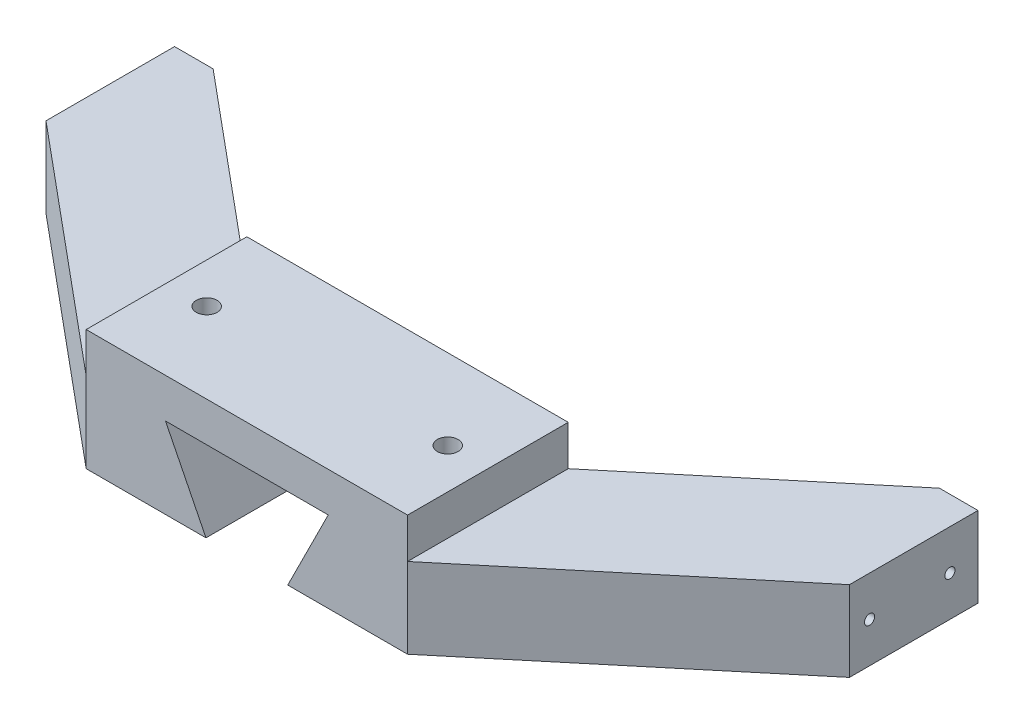
ISO-10303-21;
HEADER;
FILE_DESCRIPTION(('STEP AP214'),'2;1');
FILE_NAME('part.step','',(''),(''),'','','');
FILE_SCHEMA(('AUTOMOTIVE_DESIGN { 1 0 10303 214 1 1 1 1 }'));
ENDSEC;
DATA;
#1=APPLICATION_CONTEXT('core data for automotive mechanical design processes');
#2=APPLICATION_PROTOCOL_DEFINITION('international standard','automotive_design',2000,#1);
#3=PRODUCT_CONTEXT('',#1,'mechanical');
#4=PRODUCT('Part','Part','',(#3));
#5=PRODUCT_RELATED_PRODUCT_CATEGORY('part','',(#4));
#6=PRODUCT_DEFINITION_FORMATION('','',#4);
#7=PRODUCT_DEFINITION_CONTEXT('part definition',#1,'design');
#8=PRODUCT_DEFINITION('design','',#6,#7);
#9=PRODUCT_DEFINITION_SHAPE('','',#8);
#10=(LENGTH_UNIT() NAMED_UNIT(*) SI_UNIT(.MILLI.,.METRE.));
#11=(NAMED_UNIT(*) PLANE_ANGLE_UNIT() SI_UNIT($,.RADIAN.));
#12=(NAMED_UNIT(*) SI_UNIT($,.STERADIAN.) SOLID_ANGLE_UNIT());
#13=UNCERTAINTY_MEASURE_WITH_UNIT(LENGTH_MEASURE(1.E-05),#10,'distance_accuracy_value','');
#14=(GEOMETRIC_REPRESENTATION_CONTEXT(3) GLOBAL_UNCERTAINTY_ASSIGNED_CONTEXT((#13)) GLOBAL_UNIT_ASSIGNED_CONTEXT((#10,
#11,#12)) REPRESENTATION_CONTEXT('',''));
#15=CARTESIAN_POINT('',(0.,0.,0.));
#16=DIRECTION('',(0.,0.,1.));
#17=DIRECTION('',(1.,0.,0.));
#18=AXIS2_PLACEMENT_3D('',#15,#16,#17);
#19=CARTESIAN_POINT('',(-25.4,-9.525,25.4));
#20=DIRECTION('',(1.,0.,0.));
#21=DIRECTION('',(0.,0.,-1.));
#22=AXIS2_PLACEMENT_3D('',#19,#20,#21);
#23=PLANE('',#22);
#24=DIRECTION('',(0.,0.,-1.));
#25=VECTOR('',#24,1.);
#26=CARTESIAN_POINT('',(-25.4,3.175,25.4));
#27=LINE('',#26,#25);
#28=CARTESIAN_POINT('',(-25.4,3.175,25.4));
#29=VERTEX_POINT('',#28);
#30=CARTESIAN_POINT('',(-25.4,3.175,0.));
#31=VERTEX_POINT('',#30);
#32=EDGE_CURVE('E60',#29,#31,#27,.T.);
#33=ORIENTED_EDGE('',*,*,#32,.F.);
#34=DIRECTION('',(0.,-1.,0.));
#35=VECTOR('',#34,1.);
#36=CARTESIAN_POINT('',(-25.4,-9.525,25.4));
#37=LINE('',#36,#35);
#38=CARTESIAN_POINT('',(-25.4,9.525,25.4));
#39=VERTEX_POINT('',#38);
#40=EDGE_CURVE('E278',#39,#29,#37,.T.);
#41=ORIENTED_EDGE('',*,*,#40,.F.);
#42=DIRECTION('',(0.,0.,-1.));
#43=VECTOR('',#42,1.);
#44=CARTESIAN_POINT('',(-25.4,9.525,25.4));
#45=LINE('',#44,#43);
#46=CARTESIAN_POINT('',(-25.4,9.525,0.));
#47=VERTEX_POINT('',#46);
#48=EDGE_CURVE('E291',#39,#47,#45,.T.);
#49=ORIENTED_EDGE('',*,*,#48,.T.);
#50=DIRECTION('',(0.,-1.,0.));
#51=VECTOR('',#50,1.);
#52=CARTESIAN_POINT('',(-25.4,-9.525,0.));
#53=LINE('',#52,#51);
#54=EDGE_CURVE('E277',#47,#31,#53,.T.);
#55=ORIENTED_EDGE('',*,*,#54,.T.);
#56=EDGE_LOOP('',(#33,#41,#49,#55));
#57=FACE_BOUND('',#56,.T.);
#58=ADVANCED_FACE('F38',(#57),#23,.F.);
#59=CARTESIAN_POINT('',(25.4,-9.525,25.4));
#60=DIRECTION('',(0.,1.,0.));
#61=DIRECTION('',(-1.,0.,0.));
#62=AXIS2_PLACEMENT_3D('',#59,#60,#61);
#63=PLANE('',#62);
#64=DIRECTION('',(-1.,0.,0.));
#65=VECTOR('',#64,1.);
#66=CARTESIAN_POINT('',(0.,-9.525,-26.67));
#67=LINE('',#66,#65);
#68=CARTESIAN_POINT('',(63.5,-9.52499999999999,-26.67));
#69=VERTEX_POINT('',#68);
#70=CARTESIAN_POINT('',(57.404,-9.52499999999999,-26.67));
#71=VERTEX_POINT('',#70);
#72=EDGE_CURVE('E205',#69,#71,#67,.T.);
#73=ORIENTED_EDGE('',*,*,#72,.F.);
#74=DIRECTION('',(0.,0.,1.));
#75=VECTOR('',#74,1.);
#76=CARTESIAN_POINT('',(63.5,-9.52499999999999,-6.35));
#77=LINE('',#76,#75);
#78=CARTESIAN_POINT('',(63.5,-9.52499999999999,-6.35));
#79=VERTEX_POINT('',#78);
#80=EDGE_CURVE('E242',#69,#79,#77,.T.);
#81=ORIENTED_EDGE('',*,*,#80,.T.);
#82=DIRECTION('',(-0.768221279597376,0.,0.64018439966448));
#83=VECTOR('',#82,1.);
#84=CARTESIAN_POINT('',(25.4,-9.525,25.4));
#85=LINE('',#84,#83);
#86=CARTESIAN_POINT('',(25.4,-9.525,25.4));
#87=VERTEX_POINT('',#86);
#88=EDGE_CURVE('E231',#79,#87,#85,.T.);
#89=ORIENTED_EDGE('',*,*,#88,.T.);
#90=DIRECTION('',(1.,0.,0.));
#91=VECTOR('',#90,1.);
#92=CARTESIAN_POINT('',(25.4,-9.525,25.4));
#93=LINE('',#92,#91);
#94=CARTESIAN_POINT('',(6.46180339887498,-9.525,25.4));
#95=VERTEX_POINT('',#94);
#96=EDGE_CURVE('E280',#95,#87,#93,.T.);
#97=ORIENTED_EDGE('',*,*,#96,.F.);
#98=DIRECTION('',(0.,0.,1.));
#99=VECTOR('',#98,1.);
#100=CARTESIAN_POINT('',(6.46180339887498,-9.525,-1.2E-05));
#101=LINE('',#100,#99);
#102=CARTESIAN_POINT('',(6.46180339887498,-9.525,0.));
#103=VERTEX_POINT('',#102);
#104=EDGE_CURVE('E263',#103,#95,#101,.T.);
#105=ORIENTED_EDGE('',*,*,#104,.F.);
#106=DIRECTION('',(1.,0.,0.));
#107=VECTOR('',#106,1.);
#108=CARTESIAN_POINT('',(25.4,-9.525,0.));
#109=LINE('',#108,#107);
#110=CARTESIAN_POINT('',(25.4,-9.525,0.));
#111=VERTEX_POINT('',#110);
#112=EDGE_CURVE('E293',#103,#111,#109,.T.);
#113=ORIENTED_EDGE('',*,*,#112,.T.);
#114=DIRECTION('',(0.768221279597376,0.,-0.64018439966448));
#115=VECTOR('',#114,1.);
#116=CARTESIAN_POINT('',(63.5,-9.52499999999999,-31.75));
#117=LINE('',#116,#115);
#118=EDGE_CURVE('E226',#111,#71,#117,.T.);
#119=ORIENTED_EDGE('',*,*,#118,.T.);
#120=EDGE_LOOP('',(#73,#81,#89,#97,#105,#113,#119));
#121=FACE_BOUND('',#120,.T.);
#122=ADVANCED_FACE('F375',(#121),#63,.F.);
#123=CARTESIAN_POINT('',(63.5,3.17500000000001,-6.35));
#124=DIRECTION('',(1.,0.,0.));
#125=DIRECTION('',(0.,1.,0.));
#126=AXIS2_PLACEMENT_3D('',#123,#124,#125);
#127=PLANE('',#126);
#128=CARTESIAN_POINT('',(63.5,-3.17499999999999,-22.225));
#129=DIRECTION('',(1.,0.,0.));
#130=DIRECTION('',(0.,0.,-1.));
#131=AXIS2_PLACEMENT_3D('',#128,#129,#130);
#132=CIRCLE('',#131,0.79999999999999);
#133=CARTESIAN_POINT('',(63.5,-3.17499999999999,-23.025));
#134=VERTEX_POINT('',#133);
#135=EDGE_CURVE('E212',#134,#134,#132,.T.);
#136=ORIENTED_EDGE('',*,*,#135,.F.);
#137=EDGE_LOOP('',(#136));
#138=FACE_BOUND('',#137,.T.);
#139=CARTESIAN_POINT('',(63.5,-3.17499999999999,-9.525));
#140=DIRECTION('',(1.,0.,0.));
#141=DIRECTION('',(0.,0.,-1.));
#142=AXIS2_PLACEMENT_3D('',#139,#140,#141);
#143=CIRCLE('',#142,0.79999999999999);
#144=CARTESIAN_POINT('',(63.5,-3.17499999999999,-10.325));
#145=VERTEX_POINT('',#144);
#146=EDGE_CURVE('E220',#145,#145,#143,.T.);
#147=ORIENTED_EDGE('',*,*,#146,.F.);
#148=EDGE_LOOP('',(#147));
#149=FACE_BOUND('',#148,.T.);
#150=ORIENTED_EDGE('',*,*,#80,.F.);
#151=DIRECTION('',(0.,1.,0.));
#152=VECTOR('',#151,1.);
#153=CARTESIAN_POINT('',(63.5,-9.52499999999999,-26.67));
#154=LINE('',#153,#152);
#155=CARTESIAN_POINT('',(63.5,3.17500000000001,-26.67));
#156=VERTEX_POINT('',#155);
#157=EDGE_CURVE('E207',#69,#156,#154,.T.);
#158=ORIENTED_EDGE('',*,*,#157,.T.);
#159=DIRECTION('',(0.,0.,1.));
#160=VECTOR('',#159,1.);
#161=CARTESIAN_POINT('',(63.5,3.17500000000001,-6.35));
#162=LINE('',#161,#160);
#163=CARTESIAN_POINT('',(63.5,3.17500000000001,-6.35));
#164=VERTEX_POINT('',#163);
#165=EDGE_CURVE('E234',#156,#164,#162,.T.);
#166=ORIENTED_EDGE('',*,*,#165,.T.);
#167=DIRECTION('',(0.,-1.,0.));
#168=VECTOR('',#167,1.);
#169=CARTESIAN_POINT('',(63.5,3.17500000000001,-6.35));
#170=LINE('',#169,#168);
#171=EDGE_CURVE('E239',#164,#79,#170,.T.);
#172=ORIENTED_EDGE('',*,*,#171,.T.);
#173=EDGE_LOOP('',(#150,#158,#166,#172));
#174=FACE_BOUND('',#173,.T.);
#175=ADVANCED_FACE('F379',(#138,#149,#174),#127,.T.);
#176=CARTESIAN_POINT('',(63.5,3.17500000000001,-31.75));
#177=DIRECTION('',(-0.64018439966448,0.,-0.768221279597376));
#178=DIRECTION('',(-0.768221279597376,0.,0.64018439966448));
#179=AXIS2_PLACEMENT_3D('',#176,#177,#178);
#180=PLANE('',#179);
#181=DIRECTION('',(0.768221279597376,0.,-0.64018439966448));
#182=VECTOR('',#181,1.);
#183=CARTESIAN_POINT('',(63.5,3.17500000000001,-31.75));
#184=LINE('',#183,#182);
#185=CARTESIAN_POINT('',(25.4,3.175,0.));
#186=VERTEX_POINT('',#185);
#187=CARTESIAN_POINT('',(57.404,3.17500000000001,-26.67));
#188=VERTEX_POINT('',#187);
#189=EDGE_CURVE('E230',#186,#188,#184,.T.);
#190=ORIENTED_EDGE('',*,*,#189,.T.);
#191=DIRECTION('',(0.,1.,0.));
#192=VECTOR('',#191,1.);
#193=CARTESIAN_POINT('',(57.404,-9.52499999999999,-26.67));
#194=LINE('',#193,#192);
#195=EDGE_CURVE('E210',#71,#188,#194,.T.);
#196=ORIENTED_EDGE('',*,*,#195,.F.);
#197=ORIENTED_EDGE('',*,*,#118,.F.);
#198=DIRECTION('',(0.,1.,0.));
#199=VECTOR('',#198,1.);
#200=CARTESIAN_POINT('',(25.4,-9.525,0.));
#201=LINE('',#200,#199);
#202=EDGE_CURVE('E297',#111,#186,#201,.T.);
#203=ORIENTED_EDGE('',*,*,#202,.T.);
#204=EDGE_LOOP('',(#190,#196,#197,#203));
#205=FACE_BOUND('',#204,.T.);
#206=ADVANCED_FACE('F384',(#205),#180,.T.);
#207=CARTESIAN_POINT('',(0.,3.175,0.));
#208=DIRECTION('',(0.,1.,0.));
#209=DIRECTION('',(-1.,0.,0.));
#210=AXIS2_PLACEMENT_3D('',#207,#208,#209);
#211=PLANE('',#210);
#212=ORIENTED_EDGE('',*,*,#165,.F.);
#213=DIRECTION('',(-1.,0.,0.));
#214=VECTOR('',#213,1.);
#215=CARTESIAN_POINT('',(0.,3.175,-26.67));
#216=LINE('',#215,#214);
#217=EDGE_CURVE('E198',#156,#188,#216,.T.);
#218=ORIENTED_EDGE('',*,*,#217,.T.);
#219=ORIENTED_EDGE('',*,*,#189,.F.);
#220=DIRECTION('',(0.,0.,-1.));
#221=VECTOR('',#220,1.);
#222=CARTESIAN_POINT('',(25.4,3.175,25.4));
#223=LINE('',#222,#221);
#224=CARTESIAN_POINT('',(25.4,3.175,25.4));
#225=VERTEX_POINT('',#224);
#226=EDGE_CURVE('E227',#225,#186,#223,.T.);
#227=ORIENTED_EDGE('',*,*,#226,.F.);
#228=DIRECTION('',(-0.768221279597376,0.,0.64018439966448));
#229=VECTOR('',#228,1.);
#230=CARTESIAN_POINT('',(25.4,3.175,25.4));
#231=LINE('',#230,#229);
#232=EDGE_CURVE('E236',#164,#225,#231,.T.);
#233=ORIENTED_EDGE('',*,*,#232,.F.);
#234=EDGE_LOOP('',(#212,#218,#219,#227,#233));
#235=FACE_BOUND('',#234,.T.);
#236=ADVANCED_FACE('F391',(#235),#211,.T.);
#237=DIRECTION('',(0.,0.,1.));
#238=VECTOR('',#237,1.);
#239=CARTESIAN_POINT('',(-63.5,-9.52499999999999,-6.35));
#240=LINE('',#239,#238);
#241=CARTESIAN_POINT('',(-63.5,-9.52499999999999,-26.67));
#242=VERTEX_POINT('',#241);
#243=CARTESIAN_POINT('',(-63.5,-9.52499999999999,-6.35));
#244=VERTEX_POINT('',#243);
#245=EDGE_CURVE('E185',#242,#244,#240,.T.);
#246=ORIENTED_EDGE('',*,*,#245,.F.);
#247=DIRECTION('',(1.,0.,0.));
#248=VECTOR('',#247,1.);
#249=CARTESIAN_POINT('',(0.,-9.525,-26.67));
#250=LINE('',#249,#248);
#251=CARTESIAN_POINT('',(-57.404,-9.52499999999999,-26.67));
#252=VERTEX_POINT('',#251);
#253=EDGE_CURVE('E170',#242,#252,#250,.T.);
#254=ORIENTED_EDGE('',*,*,#253,.T.);
#255=DIRECTION('',(-0.768221279597376,0.,-0.64018439966448));
#256=VECTOR('',#255,1.);
#257=CARTESIAN_POINT('',(-63.5,-9.52499999999999,-31.75));
#258=LINE('',#257,#256);
#259=CARTESIAN_POINT('',(-25.4,-9.525,0.));
#260=VERTEX_POINT('',#259);
#261=EDGE_CURVE('E182',#260,#252,#258,.T.);
#262=ORIENTED_EDGE('',*,*,#261,.F.);
#263=CARTESIAN_POINT('',(-6.46180339887498,-9.525,0.));
#264=VERTEX_POINT('',#263);
#265=EDGE_CURVE('E294',#260,#264,#109,.T.);
#266=ORIENTED_EDGE('',*,*,#265,.T.);
#267=DIRECTION('',(0.,0.,1.));
#268=VECTOR('',#267,1.);
#269=CARTESIAN_POINT('',(-6.46180339887498,-9.525,-1.2E-05));
#270=LINE('',#269,#268);
#271=CARTESIAN_POINT('',(-6.46180339887498,-9.525,25.4));
#272=VERTEX_POINT('',#271);
#273=EDGE_CURVE('E260',#264,#272,#270,.T.);
#274=ORIENTED_EDGE('',*,*,#273,.T.);
#275=CARTESIAN_POINT('',(-25.4,-9.525,25.4));
#276=VERTEX_POINT('',#275);
#277=EDGE_CURVE('E282',#276,#272,#93,.T.);
#278=ORIENTED_EDGE('',*,*,#277,.F.);
#279=DIRECTION('',(0.768221279597376,0.,0.64018439966448));
#280=VECTOR('',#279,1.);
#281=CARTESIAN_POINT('',(-25.4,-9.525,25.4));
#282=LINE('',#281,#280);
#283=EDGE_CURVE('E193',#244,#276,#282,.T.);
#284=ORIENTED_EDGE('',*,*,#283,.F.);
#285=EDGE_LOOP('',(#246,#254,#262,#266,#274,#278,#284));
#286=FACE_BOUND('',#285,.T.);
#287=ADVANCED_FACE('F180',(#286),#63,.F.);
#288=CARTESIAN_POINT('',(25.4,-9.525,25.4));
#289=DIRECTION('',(-1.,0.,0.));
#290=DIRECTION('',(0.,0.,1.));
#291=AXIS2_PLACEMENT_3D('',#288,#289,#290);
#292=PLANE('',#291);
#293=DIRECTION('',(0.,1.,0.));
#294=VECTOR('',#293,1.);
#295=CARTESIAN_POINT('',(25.4,-9.525,25.4));
#296=LINE('',#295,#294);
#297=CARTESIAN_POINT('',(25.4,9.525,25.4));
#298=VERTEX_POINT('',#297);
#299=EDGE_CURVE('E285',#225,#298,#296,.T.);
#300=ORIENTED_EDGE('',*,*,#299,.F.);
#301=ORIENTED_EDGE('',*,*,#226,.T.);
#302=CARTESIAN_POINT('',(25.4,9.525,0.));
#303=VERTEX_POINT('',#302);
#304=EDGE_CURVE('E296',#186,#303,#201,.T.);
#305=ORIENTED_EDGE('',*,*,#304,.T.);
#306=DIRECTION('',(0.,0.,-1.));
#307=VECTOR('',#306,1.);
#308=CARTESIAN_POINT('',(25.4,9.525,25.4));
#309=LINE('',#308,#307);
#310=EDGE_CURVE('E303',#298,#303,#309,.T.);
#311=ORIENTED_EDGE('',*,*,#310,.F.);
#312=EDGE_LOOP('',(#300,#301,#305,#311));
#313=FACE_BOUND('',#312,.T.);
#314=ADVANCED_FACE('F390',(#313),#292,.F.);
#315=CARTESIAN_POINT('',(25.4,9.525,25.4));
#316=DIRECTION('',(0.,-1.,0.));
#317=DIRECTION('',(1.,0.,0.));
#318=AXIS2_PLACEMENT_3D('',#315,#316,#317);
#319=PLANE('',#318);
#320=CARTESIAN_POINT('',(19.05,9.525,12.7));
#321=DIRECTION('',(0.,1.,0.));
#322=DIRECTION('',(0.,0.,1.));
#323=AXIS2_PLACEMENT_3D('',#320,#321,#322);
#324=CIRCLE('',#323,1.65);
#325=CARTESIAN_POINT('',(19.05,9.525,14.35));
#326=VERTEX_POINT('',#325);
#327=EDGE_CURVE('E248',#326,#326,#324,.T.);
#328=ORIENTED_EDGE('',*,*,#327,.F.);
#329=EDGE_LOOP('',(#328));
#330=FACE_BOUND('',#329,.T.);
#331=CARTESIAN_POINT('',(-19.05,9.525,12.7));
#332=DIRECTION('',(0.,1.,0.));
#333=DIRECTION('',(0.,0.,1.));
#334=AXIS2_PLACEMENT_3D('',#331,#332,#333);
#335=CIRCLE('',#334,1.65);
#336=CARTESIAN_POINT('',(-19.05,9.525,14.35));
#337=VERTEX_POINT('',#336);
#338=EDGE_CURVE('E254',#337,#337,#335,.T.);
#339=ORIENTED_EDGE('',*,*,#338,.F.);
#340=EDGE_LOOP('',(#339));
#341=FACE_BOUND('',#340,.T.);
#342=DIRECTION('',(-1.,0.,0.));
#343=VECTOR('',#342,1.);
#344=CARTESIAN_POINT('',(25.4,9.525,0.));
#345=LINE('',#344,#343);
#346=EDGE_CURVE('E281',#303,#47,#345,.T.);
#347=ORIENTED_EDGE('',*,*,#346,.T.);
#348=ORIENTED_EDGE('',*,*,#48,.F.);
#349=DIRECTION('',(-1.,0.,0.));
#350=VECTOR('',#349,1.);
#351=CARTESIAN_POINT('',(25.4,9.525,25.4));
#352=LINE('',#351,#350);
#353=EDGE_CURVE('E289',#298,#39,#352,.T.);
#354=ORIENTED_EDGE('',*,*,#353,.F.);
#355=ORIENTED_EDGE('',*,*,#310,.T.);
#356=EDGE_LOOP('',(#347,#348,#354,#355));
#357=FACE_BOUND('',#356,.T.);
#358=ADVANCED_FACE('F396',(#330,#341,#357),#319,.F.);
#359=CARTESIAN_POINT('',(0.,0.,25.4));
#360=DIRECTION('',(0.,0.,1.));
#361=DIRECTION('',(1.,0.,0.));
#362=AXIS2_PLACEMENT_3D('',#359,#360,#361);
#363=PLANE('',#362);
#364=DIRECTION('',(0.447213595499958,-0.894427190999916,0.));
#365=VECTOR('',#364,1.);
#366=CARTESIAN_POINT('',(-8.97944271909999,-4.48972135955,25.4));
#367=LINE('',#366,#365);
#368=CARTESIAN_POINT('',(-12.861803398875,3.27500000000001,25.4));
#369=VERTEX_POINT('',#368);
#370=EDGE_CURVE('E275',#369,#272,#367,.T.);
#371=ORIENTED_EDGE('',*,*,#370,.F.);
#372=DIRECTION('',(-1.,0.,0.));
#373=VECTOR('',#372,1.);
#374=CARTESIAN_POINT('',(0.,3.27500000000001,25.4));
#375=LINE('',#374,#373);
#376=CARTESIAN_POINT('',(12.861803398875,3.27500000000001,25.4));
#377=VERTEX_POINT('',#376);
#378=EDGE_CURVE('E273',#377,#369,#375,.T.);
#379=ORIENTED_EDGE('',*,*,#378,.F.);
#380=DIRECTION('',(0.447213595499958,0.894427190999916,0.));
#381=VECTOR('',#380,1.);
#382=CARTESIAN_POINT('',(8.97944271909999,-4.48972135954999,25.4));
#383=LINE('',#382,#381);
#384=EDGE_CURVE('E271',#95,#377,#383,.T.);
#385=ORIENTED_EDGE('',*,*,#384,.F.);
#386=ORIENTED_EDGE('',*,*,#96,.T.);
#387=EDGE_CURVE('E286',#87,#225,#296,.T.);
#388=ORIENTED_EDGE('',*,*,#387,.T.);
#389=ORIENTED_EDGE('',*,*,#299,.T.);
#390=ORIENTED_EDGE('',*,*,#353,.T.);
#391=ORIENTED_EDGE('',*,*,#40,.T.);
#392=DIRECTION('',(0.,-1.,0.));
#393=VECTOR('',#392,1.);
#394=CARTESIAN_POINT('',(-25.4,3.175,25.4));
#395=LINE('',#394,#393);
#396=EDGE_CURVE('E202',#29,#276,#395,.T.);
#397=ORIENTED_EDGE('',*,*,#396,.T.);
#398=ORIENTED_EDGE('',*,*,#277,.T.);
#399=EDGE_LOOP('',(#371,#379,#385,#386,#388,#389,#390,#391,#397,#398));
#400=FACE_BOUND('',#399,.T.);
#401=ADVANCED_FACE('F321',(#400),#363,.T.);
#402=CARTESIAN_POINT('',(0.,0.,0.));
#403=DIRECTION('',(0.,0.,1.));
#404=DIRECTION('',(1.,0.,0.));
#405=AXIS2_PLACEMENT_3D('',#402,#403,#404);
#406=PLANE('',#405);
#407=DIRECTION('',(-1.,0.,0.));
#408=VECTOR('',#407,1.);
#409=CARTESIAN_POINT('',(0.,3.27500000000001,0.));
#410=LINE('',#409,#408);
#411=CARTESIAN_POINT('',(12.861803398875,3.27500000000001,0.));
#412=VERTEX_POINT('',#411);
#413=CARTESIAN_POINT('',(-12.861803398875,3.27500000000001,0.));
#414=VERTEX_POINT('',#413);
#415=EDGE_CURVE('E45',#412,#414,#410,.T.);
#416=ORIENTED_EDGE('',*,*,#415,.T.);
#417=DIRECTION('',(0.447213595499958,-0.894427190999916,0.));
#418=VECTOR('',#417,1.);
#419=CARTESIAN_POINT('',(-8.97944271909999,-4.48972135955,0.));
#420=LINE('',#419,#418);
#421=EDGE_CURVE('E11',#414,#264,#420,.T.);
#422=ORIENTED_EDGE('',*,*,#421,.T.);
#423=ORIENTED_EDGE('',*,*,#265,.F.);
#424=DIRECTION('',(0.,-1.,0.));
#425=VECTOR('',#424,1.);
#426=CARTESIAN_POINT('',(-25.4,3.175,0.));
#427=LINE('',#426,#425);
#428=EDGE_CURVE('E189',#31,#260,#427,.T.);
#429=ORIENTED_EDGE('',*,*,#428,.F.);
#430=ORIENTED_EDGE('',*,*,#54,.F.);
#431=ORIENTED_EDGE('',*,*,#346,.F.);
#432=ORIENTED_EDGE('',*,*,#304,.F.);
#433=ORIENTED_EDGE('',*,*,#202,.F.);
#434=ORIENTED_EDGE('',*,*,#112,.F.);
#435=DIRECTION('',(0.447213595499958,0.894427190999916,0.));
#436=VECTOR('',#435,1.);
#437=CARTESIAN_POINT('',(8.97944271909999,-4.48972135954999,0.));
#438=LINE('',#437,#436);
#439=EDGE_CURVE('E306',#103,#412,#438,.T.);
#440=ORIENTED_EDGE('',*,*,#439,.T.);
#441=EDGE_LOOP('',(#416,#422,#423,#429,#430,#431,#432,#433,#434,#440));
#442=FACE_BOUND('',#441,.T.);
#443=ADVANCED_FACE('F311',(#442),#406,.F.);
#444=CARTESIAN_POINT('',(-8.97944271909999,-4.48972135955,-1.2E-05));
#445=DIRECTION('',(-0.894427190999916,-0.447213595499958,0.));
#446=DIRECTION('',(0.447213595499958,-0.894427190999916,0.));
#447=AXIS2_PLACEMENT_3D('',#444,#445,#446);
#448=PLANE('',#447);
#449=ORIENTED_EDGE('',*,*,#370,.T.);
#450=ORIENTED_EDGE('',*,*,#273,.F.);
#451=ORIENTED_EDGE('',*,*,#421,.F.);
#452=DIRECTION('',(0.,0.,1.));
#453=VECTOR('',#452,1.);
#454=CARTESIAN_POINT('',(-12.861803398875,3.27500000000001,-1.2E-05));
#455=LINE('',#454,#453);
#456=EDGE_CURVE('E268',#414,#369,#455,.T.);
#457=ORIENTED_EDGE('',*,*,#456,.T.);
#458=EDGE_LOOP('',(#449,#450,#451,#457));
#459=FACE_BOUND('',#458,.T.);
#460=ADVANCED_FACE('F319',(#459),#448,.F.);
#461=CARTESIAN_POINT('',(0.,3.27500000000001,-1.2E-05));
#462=DIRECTION('',(0.,1.,0.));
#463=DIRECTION('',(0.,0.,1.));
#464=AXIS2_PLACEMENT_3D('',#461,#462,#463);
#465=PLANE('',#464);
#466=ORIENTED_EDGE('',*,*,#378,.T.);
#467=ORIENTED_EDGE('',*,*,#456,.F.);
#468=ORIENTED_EDGE('',*,*,#415,.F.);
#469=DIRECTION('',(0.,0.,1.));
#470=VECTOR('',#469,1.);
#471=CARTESIAN_POINT('',(12.861803398875,3.27500000000001,-1.2E-05));
#472=LINE('',#471,#470);
#473=EDGE_CURVE('E265',#412,#377,#472,.T.);
#474=ORIENTED_EDGE('',*,*,#473,.T.);
#475=EDGE_LOOP('',(#466,#467,#468,#474));
#476=FACE_BOUND('',#475,.T.);
#477=ADVANCED_FACE('F315',(#476),#465,.F.);
#478=CARTESIAN_POINT('',(8.97944271909999,-4.48972135954999,-1.2E-05));
#479=DIRECTION('',(0.894427190999916,-0.447213595499958,0.));
#480=DIRECTION('',(0.447213595499958,0.894427190999916,0.));
#481=AXIS2_PLACEMENT_3D('',#478,#479,#480);
#482=PLANE('',#481);
#483=ORIENTED_EDGE('',*,*,#384,.T.);
#484=ORIENTED_EDGE('',*,*,#473,.F.);
#485=ORIENTED_EDGE('',*,*,#439,.F.);
#486=ORIENTED_EDGE('',*,*,#104,.T.);
#487=EDGE_LOOP('',(#483,#484,#485,#486));
#488=FACE_BOUND('',#487,.T.);
#489=ADVANCED_FACE('F429',(#488),#482,.F.);
#490=CARTESIAN_POINT('',(-19.05,-0.584200000000003,12.7));
#491=DIRECTION('',(0.,1.,0.));
#492=DIRECTION('',(0.,0.,1.));
#493=AXIS2_PLACEMENT_3D('',#490,#491,#492);
#494=CONICAL_SURFACE('',#493,1.65,1.02974425867665);
#495=CARTESIAN_POINT('',(-19.05,-1.57562002139548,12.7));
#496=VERTEX_POINT('',#495);
#497=VERTEX_LOOP('',#496);
#498=FACE_BOUND('',#497,.T.);
#499=CARTESIAN_POINT('',(-19.05,-0.584200000000003,12.7));
#500=DIRECTION('',(0.,1.,0.));
#501=DIRECTION('',(0.,0.,1.));
#502=AXIS2_PLACEMENT_3D('',#499,#500,#501);
#503=CIRCLE('',#502,1.65);
#504=CARTESIAN_POINT('',(-19.05,-0.584200000000003,14.35));
#505=VERTEX_POINT('',#504);
#506=EDGE_CURVE('E257',#505,#505,#503,.T.);
#507=ORIENTED_EDGE('',*,*,#506,.T.);
#508=EDGE_LOOP('',(#507));
#509=FACE_BOUND('',#508,.T.);
#510=ADVANCED_FACE('F425',(#498,#509),#494,.F.);
#511=CARTESIAN_POINT('',(-19.05,9.525,12.7));
#512=DIRECTION('',(0.,1.,0.));
#513=DIRECTION('',(0.,0.,1.));
#514=AXIS2_PLACEMENT_3D('',#511,#512,#513);
#515=CYLINDRICAL_SURFACE('',#514,1.65);
#516=ORIENTED_EDGE('',*,*,#506,.F.);
#517=EDGE_LOOP('',(#516));
#518=FACE_BOUND('',#517,.T.);
#519=ORIENTED_EDGE('',*,*,#338,.T.);
#520=EDGE_LOOP('',(#519));
#521=FACE_BOUND('',#520,.T.);
#522=ADVANCED_FACE('F421',(#518,#521),#515,.F.);
#523=CARTESIAN_POINT('',(19.05,-0.584199999999996,12.7));
#524=DIRECTION('',(0.,1.,0.));
#525=DIRECTION('',(0.,0.,1.));
#526=AXIS2_PLACEMENT_3D('',#523,#524,#525);
#527=CONICAL_SURFACE('',#526,1.65,1.02974425867665);
#528=CARTESIAN_POINT('',(19.05,-1.57562002139547,12.7));
#529=VERTEX_POINT('',#528);
#530=VERTEX_LOOP('',#529);
#531=FACE_BOUND('',#530,.T.);
#532=CARTESIAN_POINT('',(19.05,-0.584199999999996,12.7));
#533=DIRECTION('',(0.,1.,0.));
#534=DIRECTION('',(0.,0.,1.));
#535=AXIS2_PLACEMENT_3D('',#532,#533,#534);
#536=CIRCLE('',#535,1.65);
#537=CARTESIAN_POINT('',(19.05,-0.584199999999996,14.35));
#538=VERTEX_POINT('',#537);
#539=EDGE_CURVE('E251',#538,#538,#536,.T.);
#540=ORIENTED_EDGE('',*,*,#539,.T.);
#541=EDGE_LOOP('',(#540));
#542=FACE_BOUND('',#541,.T.);
#543=ADVANCED_FACE('F417',(#531,#542),#527,.F.);
#544=CARTESIAN_POINT('',(19.05,9.525,12.7));
#545=DIRECTION('',(0.,1.,0.));
#546=DIRECTION('',(0.,0.,1.));
#547=AXIS2_PLACEMENT_3D('',#544,#545,#546);
#548=CYLINDRICAL_SURFACE('',#547,1.65);
#549=ORIENTED_EDGE('',*,*,#539,.F.);
#550=EDGE_LOOP('',(#549));
#551=FACE_BOUND('',#550,.T.);
#552=ORIENTED_EDGE('',*,*,#327,.T.);
#553=EDGE_LOOP('',(#552));
#554=FACE_BOUND('',#553,.T.);
#555=ADVANCED_FACE('F412',(#551,#554),#548,.F.);
#556=CARTESIAN_POINT('',(25.4,3.175,25.4));
#557=DIRECTION('',(0.64018439966448,0.,0.768221279597376));
#558=DIRECTION('',(0.768221279597376,0.,-0.64018439966448));
#559=AXIS2_PLACEMENT_3D('',#556,#557,#558);
#560=PLANE('',#559);
#561=ORIENTED_EDGE('',*,*,#88,.F.);
#562=ORIENTED_EDGE('',*,*,#171,.F.);
#563=ORIENTED_EDGE('',*,*,#232,.T.);
#564=ORIENTED_EDGE('',*,*,#387,.F.);
#565=EDGE_LOOP('',(#561,#562,#563,#564));
#566=FACE_BOUND('',#565,.T.);
#567=ADVANCED_FACE('F410',(#566),#560,.T.);
#568=CARTESIAN_POINT('',(57.15,-3.17499999999999,-9.525));
#569=DIRECTION('',(1.,0.,0.));
#570=DIRECTION('',(0.,0.,-1.));
#571=AXIS2_PLACEMENT_3D('',#568,#569,#570);
#572=CONICAL_SURFACE('',#571,0.799999999999997,1.02974425867666);
#573=CARTESIAN_POINT('',(56.669311504778,-3.175,-9.525));
#574=VERTEX_POINT('',#573);
#575=VERTEX_LOOP('',#574);
#576=FACE_BOUND('',#575,.T.);
#577=CARTESIAN_POINT('',(57.15,-3.17499999999999,-9.525));
#578=DIRECTION('',(1.,0.,0.));
#579=DIRECTION('',(0.,0.,-1.));
#580=AXIS2_PLACEMENT_3D('',#577,#578,#579);
#581=CIRCLE('',#580,0.799999999999997);
#582=CARTESIAN_POINT('',(57.15,-3.17499999999999,-10.325));
#583=VERTEX_POINT('',#582);
#584=EDGE_CURVE('E223',#583,#583,#581,.T.);
#585=ORIENTED_EDGE('',*,*,#584,.T.);
#586=EDGE_LOOP('',(#585));
#587=FACE_BOUND('',#586,.T.);
#588=ADVANCED_FACE('F408',(#576,#587),#572,.F.);
#589=CARTESIAN_POINT('',(63.5,-3.17499999999999,-9.525));
#590=DIRECTION('',(1.,0.,0.));
#591=DIRECTION('',(0.,0.,-1.));
#592=AXIS2_PLACEMENT_3D('',#589,#590,#591);
#593=CYLINDRICAL_SURFACE('',#592,0.799999999999993);
#594=ORIENTED_EDGE('',*,*,#584,.F.);
#595=EDGE_LOOP('',(#594));
#596=FACE_BOUND('',#595,.T.);
#597=ORIENTED_EDGE('',*,*,#146,.T.);
#598=EDGE_LOOP('',(#597));
#599=FACE_BOUND('',#598,.T.);
#600=ADVANCED_FACE('F482',(#596,#599),#593,.F.);
#601=CARTESIAN_POINT('',(57.15,-3.17499999999999,-22.225));
#602=DIRECTION('',(1.,0.,0.));
#603=DIRECTION('',(0.,0.,-1.));
#604=AXIS2_PLACEMENT_3D('',#601,#602,#603);
#605=CONICAL_SURFACE('',#604,0.799999999999997,1.02974425867666);
#606=CARTESIAN_POINT('',(56.669311504778,-3.17499999999999,-22.225));
#607=VERTEX_POINT('',#606);
#608=VERTEX_LOOP('',#607);
#609=FACE_BOUND('',#608,.T.);
#610=CARTESIAN_POINT('',(57.15,-3.17499999999999,-22.225));
#611=DIRECTION('',(1.,0.,0.));
#612=DIRECTION('',(0.,0.,-1.));
#613=AXIS2_PLACEMENT_3D('',#610,#611,#612);
#614=CIRCLE('',#613,0.799999999999997);
#615=CARTESIAN_POINT('',(57.15,-3.17499999999999,-23.025));
#616=VERTEX_POINT('',#615);
#617=EDGE_CURVE('E217',#616,#616,#614,.T.);
#618=ORIENTED_EDGE('',*,*,#617,.T.);
#619=EDGE_LOOP('',(#618));
#620=FACE_BOUND('',#619,.T.);
#621=ADVANCED_FACE('F477',(#609,#620),#605,.F.);
#622=CARTESIAN_POINT('',(63.5,-3.17499999999999,-22.225));
#623=DIRECTION('',(1.,0.,0.));
#624=DIRECTION('',(0.,0.,-1.));
#625=AXIS2_PLACEMENT_3D('',#622,#623,#624);
#626=CYLINDRICAL_SURFACE('',#625,0.799999999999993);
#627=ORIENTED_EDGE('',*,*,#617,.F.);
#628=EDGE_LOOP('',(#627));
#629=FACE_BOUND('',#628,.T.);
#630=ORIENTED_EDGE('',*,*,#135,.T.);
#631=EDGE_LOOP('',(#630));
#632=FACE_BOUND('',#631,.T.);
#633=ADVANCED_FACE('F471',(#629,#632),#626,.F.);
#634=CARTESIAN_POINT('',(0.,-9.525,-26.67));
#635=DIRECTION('',(0.,0.,-1.));
#636=DIRECTION('',(-1.,0.,0.));
#637=AXIS2_PLACEMENT_3D('',#634,#635,#636);
#638=PLANE('',#637);
#639=ORIENTED_EDGE('',*,*,#217,.F.);
#640=ORIENTED_EDGE('',*,*,#157,.F.);
#641=ORIENTED_EDGE('',*,*,#72,.T.);
#642=ORIENTED_EDGE('',*,*,#195,.T.);
#643=EDGE_LOOP('',(#639,#640,#641,#642));
#644=FACE_BOUND('',#643,.T.);
#645=ADVANCED_FACE('F468',(#644),#638,.T.);
#646=CARTESIAN_POINT('',(-63.5,3.17500000000001,-31.75));
#647=DIRECTION('',(-0.64018439966448,0.,0.768221279597376));
#648=DIRECTION('',(0.768221279597376,0.,0.64018439966448));
#649=AXIS2_PLACEMENT_3D('',#646,#647,#648);
#650=PLANE('',#649);
#651=ORIENTED_EDGE('',*,*,#261,.T.);
#652=DIRECTION('',(0.,1.,0.));
#653=VECTOR('',#652,1.);
#654=CARTESIAN_POINT('',(-57.404,-9.52499999999999,-26.67));
#655=LINE('',#654,#653);
#656=CARTESIAN_POINT('',(-57.404,3.17500000000001,-26.67));
#657=VERTEX_POINT('',#656);
#658=EDGE_CURVE('E167',#252,#657,#655,.T.);
#659=ORIENTED_EDGE('',*,*,#658,.T.);
#660=DIRECTION('',(-0.768221279597376,0.,-0.64018439966448));
#661=VECTOR('',#660,1.);
#662=CARTESIAN_POINT('',(-63.5,3.17500000000001,-31.75));
#663=LINE('',#662,#661);
#664=EDGE_CURVE('E204',#31,#657,#663,.T.);
#665=ORIENTED_EDGE('',*,*,#664,.F.);
#666=ORIENTED_EDGE('',*,*,#428,.T.);
#667=EDGE_LOOP('',(#651,#659,#665,#666));
#668=FACE_BOUND('',#667,.T.);
#669=ADVANCED_FACE('F187',(#668),#650,.F.);
#670=CARTESIAN_POINT('',(-63.5,3.17500000000001,-6.35));
#671=DIRECTION('',(1.,0.,0.));
#672=DIRECTION('',(0.,1.,0.));
#673=AXIS2_PLACEMENT_3D('',#670,#671,#672);
#674=PLANE('',#673);
#675=CARTESIAN_POINT('',(-63.5,-3.17499999999999,-22.225));
#676=DIRECTION('',(-1.,0.,0.));
#677=DIRECTION('',(0.,0.,1.));
#678=AXIS2_PLACEMENT_3D('',#675,#676,#677);
#679=CIRCLE('',#678,0.79999999999999);
#680=CARTESIAN_POINT('',(-63.5,-3.17499999999999,-21.425));
#681=VERTEX_POINT('',#680);
#682=EDGE_CURVE('E345',#681,#681,#679,.T.);
#683=ORIENTED_EDGE('',*,*,#682,.F.);
#684=EDGE_LOOP('',(#683));
#685=FACE_BOUND('',#684,.T.);
#686=CARTESIAN_POINT('',(-63.5,-3.17499999999999,-9.525));
#687=DIRECTION('',(-1.,0.,0.));
#688=DIRECTION('',(0.,0.,1.));
#689=AXIS2_PLACEMENT_3D('',#686,#687,#688);
#690=CIRCLE('',#689,0.79999999999999);
#691=CARTESIAN_POINT('',(-63.5,-3.17499999999999,-8.72500000000001));
#692=VERTEX_POINT('',#691);
#693=EDGE_CURVE('E332',#692,#692,#690,.T.);
#694=ORIENTED_EDGE('',*,*,#693,.F.);
#695=EDGE_LOOP('',(#694));
#696=FACE_BOUND('',#695,.T.);
#697=DIRECTION('',(0.,0.,1.));
#698=VECTOR('',#697,1.);
#699=CARTESIAN_POINT('',(-63.5,3.17500000000001,-6.35));
#700=LINE('',#699,#698);
#701=CARTESIAN_POINT('',(-63.5,3.17500000000001,-26.67));
#702=VERTEX_POINT('',#701);
#703=CARTESIAN_POINT('',(-63.5,3.17500000000001,-6.35));
#704=VERTEX_POINT('',#703);
#705=EDGE_CURVE('E336',#702,#704,#700,.T.);
#706=ORIENTED_EDGE('',*,*,#705,.F.);
#707=DIRECTION('',(0.,1.,0.));
#708=VECTOR('',#707,1.);
#709=CARTESIAN_POINT('',(-63.5,-9.52499999999999,-26.67));
#710=LINE('',#709,#708);
#711=EDGE_CURVE('E52',#242,#702,#710,.T.);
#712=ORIENTED_EDGE('',*,*,#711,.F.);
#713=ORIENTED_EDGE('',*,*,#245,.T.);
#714=DIRECTION('',(0.,-1.,0.));
#715=VECTOR('',#714,1.);
#716=CARTESIAN_POINT('',(-63.5,3.17500000000001,-6.35));
#717=LINE('',#716,#715);
#718=EDGE_CURVE('E199',#704,#244,#717,.T.);
#719=ORIENTED_EDGE('',*,*,#718,.F.);
#720=EDGE_LOOP('',(#706,#712,#713,#719));
#721=FACE_BOUND('',#720,.T.);
#722=ADVANCED_FACE('F353',(#685,#696,#721),#674,.F.);
#723=CARTESIAN_POINT('',(-25.4,3.175,25.4));
#724=DIRECTION('',(0.64018439966448,0.,-0.768221279597376));
#725=DIRECTION('',(-0.768221279597376,0.,-0.64018439966448));
#726=AXIS2_PLACEMENT_3D('',#723,#724,#725);
#727=PLANE('',#726);
#728=ORIENTED_EDGE('',*,*,#283,.T.);
#729=ORIENTED_EDGE('',*,*,#396,.F.);
#730=DIRECTION('',(0.768221279597376,0.,0.64018439966448));
#731=VECTOR('',#730,1.);
#732=CARTESIAN_POINT('',(-25.4,3.175,25.4));
#733=LINE('',#732,#731);
#734=EDGE_CURVE('E191',#704,#29,#733,.T.);
#735=ORIENTED_EDGE('',*,*,#734,.F.);
#736=ORIENTED_EDGE('',*,*,#718,.T.);
#737=EDGE_LOOP('',(#728,#729,#735,#736));
#738=FACE_BOUND('',#737,.T.);
#739=ADVANCED_FACE('F327',(#738),#727,.F.);
#740=CARTESIAN_POINT('',(0.,3.175,0.));
#741=DIRECTION('',(0.,1.,0.));
#742=DIRECTION('',(1.,0.,0.));
#743=AXIS2_PLACEMENT_3D('',#740,#741,#742);
#744=PLANE('',#743);
#745=DIRECTION('',(1.,0.,0.));
#746=VECTOR('',#745,1.);
#747=CARTESIAN_POINT('',(0.,3.175,-26.67));
#748=LINE('',#747,#746);
#749=EDGE_CURVE('E171',#702,#657,#748,.T.);
#750=ORIENTED_EDGE('',*,*,#749,.F.);
#751=ORIENTED_EDGE('',*,*,#705,.T.);
#752=ORIENTED_EDGE('',*,*,#734,.T.);
#753=ORIENTED_EDGE('',*,*,#32,.T.);
#754=ORIENTED_EDGE('',*,*,#664,.T.);
#755=EDGE_LOOP('',(#750,#751,#752,#753,#754));
#756=FACE_BOUND('',#755,.T.);
#757=ADVANCED_FACE('F361',(#756),#744,.T.);
#758=CARTESIAN_POINT('',(-57.15,-3.17499999999999,-9.525));
#759=DIRECTION('',(-1.,0.,0.));
#760=DIRECTION('',(0.,0.,1.));
#761=AXIS2_PLACEMENT_3D('',#758,#759,#760);
#762=CONICAL_SURFACE('',#761,0.799999999999997,1.02974425867666);
#763=CARTESIAN_POINT('',(-56.669311504778,-3.175,-9.525));
#764=VERTEX_POINT('',#763);
#765=VERTEX_LOOP('',#764);
#766=FACE_BOUND('',#765,.T.);
#767=CARTESIAN_POINT('',(-57.15,-3.17499999999999,-9.525));
#768=DIRECTION('',(-1.,0.,0.));
#769=DIRECTION('',(0.,0.,1.));
#770=AXIS2_PLACEMENT_3D('',#767,#768,#769);
#771=CIRCLE('',#770,0.799999999999997);
#772=CARTESIAN_POINT('',(-57.15,-3.17499999999999,-8.725));
#773=VERTEX_POINT('',#772);
#774=EDGE_CURVE('E330',#773,#773,#771,.T.);
#775=ORIENTED_EDGE('',*,*,#774,.T.);
#776=EDGE_LOOP('',(#775));
#777=FACE_BOUND('',#776,.T.);
#778=ADVANCED_FACE('F363',(#766,#777),#762,.F.);
#779=CARTESIAN_POINT('',(-63.5,-3.17499999999999,-9.525));
#780=DIRECTION('',(-1.,0.,0.));
#781=DIRECTION('',(0.,0.,1.));
#782=AXIS2_PLACEMENT_3D('',#779,#780,#781);
#783=CYLINDRICAL_SURFACE('',#782,0.799999999999993);
#784=ORIENTED_EDGE('',*,*,#774,.F.);
#785=EDGE_LOOP('',(#784));
#786=FACE_BOUND('',#785,.T.);
#787=ORIENTED_EDGE('',*,*,#693,.T.);
#788=EDGE_LOOP('',(#787));
#789=FACE_BOUND('',#788,.T.);
#790=ADVANCED_FACE('F369',(#786,#789),#783,.F.);
#791=CARTESIAN_POINT('',(-57.15,-3.17499999999999,-22.225));
#792=DIRECTION('',(-1.,0.,0.));
#793=DIRECTION('',(0.,0.,1.));
#794=AXIS2_PLACEMENT_3D('',#791,#792,#793);
#795=CONICAL_SURFACE('',#794,0.799999999999997,1.02974425867666);
#796=CARTESIAN_POINT('',(-56.669311504778,-3.17499999999999,-22.225));
#797=VERTEX_POINT('',#796);
#798=VERTEX_LOOP('',#797);
#799=FACE_BOUND('',#798,.T.);
#800=CARTESIAN_POINT('',(-57.15,-3.17499999999999,-22.225));
#801=DIRECTION('',(-1.,0.,0.));
#802=DIRECTION('',(0.,0.,1.));
#803=AXIS2_PLACEMENT_3D('',#800,#801,#802);
#804=CIRCLE('',#803,0.799999999999997);
#805=CARTESIAN_POINT('',(-57.15,-3.17499999999999,-21.425));
#806=VERTEX_POINT('',#805);
#807=EDGE_CURVE('E342',#806,#806,#804,.T.);
#808=ORIENTED_EDGE('',*,*,#807,.T.);
#809=EDGE_LOOP('',(#808));
#810=FACE_BOUND('',#809,.T.);
#811=ADVANCED_FACE('F640',(#799,#810),#795,.F.);
#812=CARTESIAN_POINT('',(-63.5,-3.17499999999999,-22.225));
#813=DIRECTION('',(-1.,0.,0.));
#814=DIRECTION('',(0.,0.,1.));
#815=AXIS2_PLACEMENT_3D('',#812,#813,#814);
#816=CYLINDRICAL_SURFACE('',#815,0.799999999999993);
#817=ORIENTED_EDGE('',*,*,#807,.F.);
#818=EDGE_LOOP('',(#817));
#819=FACE_BOUND('',#818,.T.);
#820=ORIENTED_EDGE('',*,*,#682,.T.);
#821=EDGE_LOOP('',(#820));
#822=FACE_BOUND('',#821,.T.);
#823=ADVANCED_FACE('F351',(#819,#822),#816,.F.);
#824=CARTESIAN_POINT('',(0.,-9.525,-26.67));
#825=DIRECTION('',(0.,0.,1.));
#826=DIRECTION('',(1.,0.,0.));
#827=AXIS2_PLACEMENT_3D('',#824,#825,#826);
#828=PLANE('',#827);
#829=ORIENTED_EDGE('',*,*,#749,.T.);
#830=ORIENTED_EDGE('',*,*,#658,.F.);
#831=ORIENTED_EDGE('',*,*,#253,.F.);
#832=ORIENTED_EDGE('',*,*,#711,.T.);
#833=EDGE_LOOP('',(#829,#830,#831,#832));
#834=FACE_BOUND('',#833,.T.);
#835=ADVANCED_FACE('F169',(#834),#828,.F.);
#836=CLOSED_SHELL('',(#58,#122,#175,#206,#236,#287,#314,#358,#401,#443,#460,#477,#489,#510,#522,
#543,#555,#567,#588,#600,#621,#633,#645,#669,#722,#739,#757,#778,#790,#811,#823,#835));
#837=MANIFOLD_SOLID_BREP('B2',#836);
#838=ADVANCED_BREP_SHAPE_REPRESENTATION('',(#18,#837),#14);
#839=SHAPE_DEFINITION_REPRESENTATION(#9,#838);
ENDSEC;
END-ISO-10303-21;
